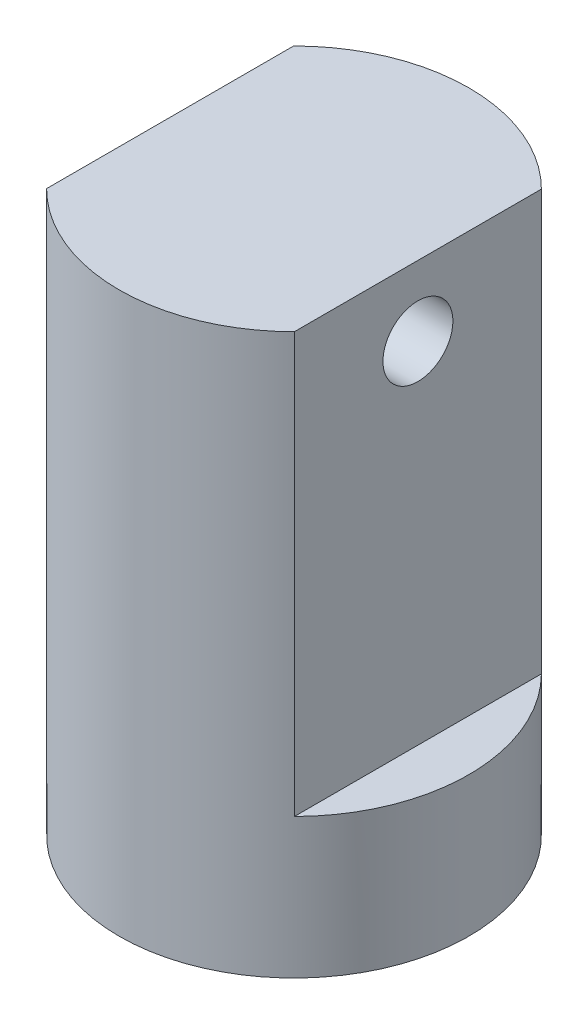
ISO-10303-21;
HEADER;
FILE_DESCRIPTION(('STEP AP214'),'2;1');
FILE_NAME('part.step','',(''),(''),'','','');
FILE_SCHEMA(('AUTOMOTIVE_DESIGN { 1 0 10303 214 1 1 1 1 }'));
ENDSEC;
DATA;
#1=APPLICATION_CONTEXT('core data for automotive mechanical design processes');
#2=APPLICATION_PROTOCOL_DEFINITION('international standard','automotive_design',2000,#1);
#3=PRODUCT_CONTEXT('',#1,'mechanical');
#4=PRODUCT('Part','Part','',(#3));
#5=PRODUCT_RELATED_PRODUCT_CATEGORY('part','',(#4));
#6=PRODUCT_DEFINITION_FORMATION('','',#4);
#7=PRODUCT_DEFINITION_CONTEXT('part definition',#1,'design');
#8=PRODUCT_DEFINITION('design','',#6,#7);
#9=PRODUCT_DEFINITION_SHAPE('','',#8);
#10=(LENGTH_UNIT() NAMED_UNIT(*) SI_UNIT(.MILLI.,.METRE.));
#11=(NAMED_UNIT(*) PLANE_ANGLE_UNIT() SI_UNIT($,.RADIAN.));
#12=(NAMED_UNIT(*) SI_UNIT($,.STERADIAN.) SOLID_ANGLE_UNIT());
#13=UNCERTAINTY_MEASURE_WITH_UNIT(LENGTH_MEASURE(1.E-05),#10,'distance_accuracy_value','');
#14=(GEOMETRIC_REPRESENTATION_CONTEXT(3) GLOBAL_UNCERTAINTY_ASSIGNED_CONTEXT((#13)) GLOBAL_UNIT_ASSIGNED_CONTEXT((#10,
#11,#12)) REPRESENTATION_CONTEXT('',''));
#15=CARTESIAN_POINT('',(0.,0.,0.));
#16=DIRECTION('',(0.,0.,1.));
#17=DIRECTION('',(1.,0.,0.));
#18=AXIS2_PLACEMENT_3D('',#15,#16,#17);
#19=CARTESIAN_POINT('',(0.,80.,0.));
#20=DIRECTION('',(0.,-1.,0.));
#21=DIRECTION('',(0.,0.,-1.));
#22=AXIS2_PLACEMENT_3D('',#19,#20,#21);
#23=CYLINDRICAL_SURFACE('',#22,25.);
#24=CARTESIAN_POINT('',(0.,80.,0.));
#25=DIRECTION('',(0.,1.,0.));
#26=DIRECTION('',(0.,0.,1.));
#27=AXIS2_PLACEMENT_3D('',#24,#25,#26);
#28=CIRCLE('',#27,25.);
#29=CARTESIAN_POINT('',(17.7081928215064,80.,-17.647093443294));
#30=VERTEX_POINT('',#29);
#31=CARTESIAN_POINT('',(-17.7081928215064,80.,-17.647093443294));
#32=VERTEX_POINT('',#31);
#33=EDGE_CURVE('E41',#30,#32,#28,.T.);
#34=ORIENTED_EDGE('',*,*,#33,.F.);
#35=DIRECTION('',(0.,1.,0.));
#36=VECTOR('',#35,1.);
#37=CARTESIAN_POINT('',(17.7081928215064,20.,-17.647093443294));
#38=LINE('',#37,#36);
#39=CARTESIAN_POINT('',(17.7081928215064,20.,-17.647093443294));
#40=VERTEX_POINT('',#39);
#41=EDGE_CURVE('E48',#40,#30,#38,.T.);
#42=ORIENTED_EDGE('',*,*,#41,.F.);
#43=CARTESIAN_POINT('',(0.,20.,0.));
#44=DIRECTION('',(0.,1.,0.));
#45=DIRECTION('',(0.,0.,1.));
#46=AXIS2_PLACEMENT_3D('',#43,#44,#45);
#47=CIRCLE('',#46,25.);
#48=CARTESIAN_POINT('',(17.7081928215064,20.,17.647093443294));
#49=VERTEX_POINT('',#48);
#50=EDGE_CURVE('E76',#49,#40,#47,.T.);
#51=ORIENTED_EDGE('',*,*,#50,.F.);
#52=DIRECTION('',(0.,1.,0.));
#53=VECTOR('',#52,1.);
#54=CARTESIAN_POINT('',(17.7081928215064,20.,17.647093443294));
#55=LINE('',#54,#53);
#56=CARTESIAN_POINT('',(17.7081928215064,80.,17.647093443294));
#57=VERTEX_POINT('',#56);
#58=EDGE_CURVE('E84',#49,#57,#55,.T.);
#59=ORIENTED_EDGE('',*,*,#58,.T.);
#60=CARTESIAN_POINT('',(-17.7081928215064,80.,17.647093443294));
#61=VERTEX_POINT('',#60);
#62=EDGE_CURVE('E11',#61,#57,#28,.T.);
#63=ORIENTED_EDGE('',*,*,#62,.F.);
#64=DIRECTION('',(0.,1.,0.));
#65=VECTOR('',#64,1.);
#66=CARTESIAN_POINT('',(-17.7081928215064,20.,17.647093443294));
#67=LINE('',#66,#65);
#68=CARTESIAN_POINT('',(-17.7081928215064,20.,17.647093443294));
#69=VERTEX_POINT('',#68);
#70=EDGE_CURVE('E56',#69,#61,#67,.T.);
#71=ORIENTED_EDGE('',*,*,#70,.F.);
#72=CARTESIAN_POINT('',(0.,20.,0.));
#73=DIRECTION('',(0.,1.,0.));
#74=DIRECTION('',(0.,0.,1.));
#75=AXIS2_PLACEMENT_3D('',#72,#73,#74);
#76=CIRCLE('',#75,25.);
#77=CARTESIAN_POINT('',(-17.7081928215064,20.,-17.647093443294));
#78=VERTEX_POINT('',#77);
#79=EDGE_CURVE('E96',#78,#69,#76,.T.);
#80=ORIENTED_EDGE('',*,*,#79,.F.);
#81=DIRECTION('',(0.,1.,0.));
#82=VECTOR('',#81,1.);
#83=CARTESIAN_POINT('',(-17.7081928215064,20.,-17.647093443294));
#84=LINE('',#83,#82);
#85=EDGE_CURVE('E99',#78,#32,#84,.T.);
#86=ORIENTED_EDGE('',*,*,#85,.T.);
#87=EDGE_LOOP('',(#34,#42,#51,#59,#63,#71,#80,#86));
#88=FACE_BOUND('',#87,.T.);
#89=CARTESIAN_POINT('',(0.,0.,0.));
#90=DIRECTION('',(0.,1.,0.));
#91=DIRECTION('',(0.,0.,1.));
#92=AXIS2_PLACEMENT_3D('',#89,#90,#91);
#93=CIRCLE('',#92,25.);
#94=CARTESIAN_POINT('',(0.,0.,25.));
#95=VERTEX_POINT('',#94);
#96=EDGE_CURVE('E36',#95,#95,#93,.T.);
#97=ORIENTED_EDGE('',*,*,#96,.T.);
#98=EDGE_LOOP('',(#97));
#99=FACE_BOUND('',#98,.T.);
#100=ADVANCED_FACE('F33',(#88,#99),#23,.T.);
#101=CARTESIAN_POINT('',(0.,80.,0.));
#102=DIRECTION('',(0.,1.,0.));
#103=DIRECTION('',(0.,0.,1.));
#104=AXIS2_PLACEMENT_3D('',#101,#102,#103);
#105=PLANE('',#104);
#106=DIRECTION('',(0.,0.,1.));
#107=VECTOR('',#106,1.);
#108=CARTESIAN_POINT('',(17.7081928215064,80.,0.));
#109=LINE('',#108,#107);
#110=EDGE_CURVE('E81',#30,#57,#109,.T.);
#111=ORIENTED_EDGE('',*,*,#110,.F.);
#112=ORIENTED_EDGE('',*,*,#33,.T.);
#113=DIRECTION('',(0.,0.,1.));
#114=VECTOR('',#113,1.);
#115=CARTESIAN_POINT('',(-17.7081928215064,80.,0.));
#116=LINE('',#115,#114);
#117=EDGE_CURVE('E90',#32,#61,#116,.T.);
#118=ORIENTED_EDGE('',*,*,#117,.T.);
#119=ORIENTED_EDGE('',*,*,#62,.T.);
#120=EDGE_LOOP('',(#111,#112,#118,#119));
#121=FACE_BOUND('',#120,.T.);
#122=ADVANCED_FACE('F109',(#121),#105,.T.);
#123=CARTESIAN_POINT('',(0.,0.,0.));
#124=DIRECTION('',(0.,1.,0.));
#125=DIRECTION('',(0.,0.,1.));
#126=AXIS2_PLACEMENT_3D('',#123,#124,#125);
#127=PLANE('',#126);
#128=CARTESIAN_POINT('',(0.,0.,0.));
#129=DIRECTION('',(0.,-1.,0.));
#130=DIRECTION('',(0.,0.,-1.));
#131=AXIS2_PLACEMENT_3D('',#128,#129,#130);
#132=CIRCLE('',#131,5.);
#133=CARTESIAN_POINT('',(0.,0.,-5.));
#134=VERTEX_POINT('',#133);
#135=EDGE_CURVE('E204',#134,#134,#132,.T.);
#136=ORIENTED_EDGE('',*,*,#135,.F.);
#137=EDGE_LOOP('',(#136));
#138=FACE_BOUND('',#137,.T.);
#139=ORIENTED_EDGE('',*,*,#96,.F.);
#140=EDGE_LOOP('',(#139));
#141=FACE_BOUND('',#140,.T.);
#142=ADVANCED_FACE('F113',(#138,#141),#127,.F.);
#143=CARTESIAN_POINT('',(-17.7081928215064,20.,0.));
#144=DIRECTION('',(-1.,0.,0.));
#145=DIRECTION('',(0.,0.,1.));
#146=AXIS2_PLACEMENT_3D('',#143,#144,#145);
#147=PLANE('',#146);
#148=CARTESIAN_POINT('',(-17.7081928215064,70.,0.));
#149=DIRECTION('',(-1.,0.,0.));
#150=DIRECTION('',(0.,0.,1.));
#151=AXIS2_PLACEMENT_3D('',#148,#149,#150);
#152=CIRCLE('',#151,5.);
#153=CARTESIAN_POINT('',(-17.7081928215064,70.,5.));
#154=VERTEX_POINT('',#153);
#155=EDGE_CURVE('E207',#154,#154,#152,.T.);
#156=ORIENTED_EDGE('',*,*,#155,.F.);
#157=EDGE_LOOP('',(#156));
#158=FACE_BOUND('',#157,.T.);
#159=ORIENTED_EDGE('',*,*,#117,.F.);
#160=ORIENTED_EDGE('',*,*,#85,.F.);
#161=DIRECTION('',(0.,0.,1.));
#162=VECTOR('',#161,1.);
#163=CARTESIAN_POINT('',(-17.7081928215064,20.,0.));
#164=LINE('',#163,#162);
#165=EDGE_CURVE('E94',#78,#69,#164,.T.);
#166=ORIENTED_EDGE('',*,*,#165,.T.);
#167=ORIENTED_EDGE('',*,*,#70,.T.);
#168=EDGE_LOOP('',(#159,#160,#166,#167));
#169=FACE_BOUND('',#168,.T.);
#170=ADVANCED_FACE('F104',(#158,#169),#147,.T.);
#171=CARTESIAN_POINT('',(0.,20.,0.));
#172=DIRECTION('',(0.,1.,0.));
#173=DIRECTION('',(0.,0.,1.));
#174=AXIS2_PLACEMENT_3D('',#171,#172,#173);
#175=PLANE('',#174);
#176=ORIENTED_EDGE('',*,*,#165,.F.);
#177=ORIENTED_EDGE('',*,*,#79,.T.);
#178=EDGE_LOOP('',(#176,#177));
#179=FACE_BOUND('',#178,.T.);
#180=ADVANCED_FACE('F106',(#179),#175,.T.);
#181=CARTESIAN_POINT('',(17.7081928215064,20.,0.));
#182=DIRECTION('',(-1.,0.,0.));
#183=DIRECTION('',(0.,0.,1.));
#184=AXIS2_PLACEMENT_3D('',#181,#182,#183);
#185=PLANE('',#184);
#186=CARTESIAN_POINT('',(17.7081928215064,70.,0.));
#187=DIRECTION('',(1.,0.,0.));
#188=DIRECTION('',(0.,0.,-1.));
#189=AXIS2_PLACEMENT_3D('',#186,#187,#188);
#190=CIRCLE('',#189,5.);
#191=CARTESIAN_POINT('',(17.7081928215064,70.,-5.));
#192=VERTEX_POINT('',#191);
#193=EDGE_CURVE('E203',#192,#192,#190,.T.);
#194=ORIENTED_EDGE('',*,*,#193,.F.);
#195=EDGE_LOOP('',(#194));
#196=FACE_BOUND('',#195,.T.);
#197=ORIENTED_EDGE('',*,*,#110,.T.);
#198=ORIENTED_EDGE('',*,*,#58,.F.);
#199=DIRECTION('',(0.,0.,1.));
#200=VECTOR('',#199,1.);
#201=CARTESIAN_POINT('',(17.7081928215064,20.,0.));
#202=LINE('',#201,#200);
#203=EDGE_CURVE('E78',#40,#49,#202,.T.);
#204=ORIENTED_EDGE('',*,*,#203,.F.);
#205=ORIENTED_EDGE('',*,*,#41,.T.);
#206=EDGE_LOOP('',(#197,#198,#204,#205));
#207=FACE_BOUND('',#206,.T.);
#208=ADVANCED_FACE('F83',(#196,#207),#185,.F.);
#209=CARTESIAN_POINT('',(0.,20.,0.));
#210=DIRECTION('',(0.,1.,0.));
#211=DIRECTION('',(0.,0.,1.));
#212=AXIS2_PLACEMENT_3D('',#209,#210,#211);
#213=PLANE('',#212);
#214=ORIENTED_EDGE('',*,*,#50,.T.);
#215=ORIENTED_EDGE('',*,*,#203,.T.);
#216=EDGE_LOOP('',(#214,#215));
#217=FACE_BOUND('',#216,.T.);
#218=ADVANCED_FACE('F77',(#217),#213,.T.);
#219=CARTESIAN_POINT('',(-42.2918071784936,70.,0.));
#220=DIRECTION('',(1.,0.,0.));
#221=DIRECTION('',(0.,0.,-1.));
#222=AXIS2_PLACEMENT_3D('',#219,#220,#221);
#223=CYLINDRICAL_SURFACE('',#222,5.);
#224=ORIENTED_EDGE('',*,*,#155,.T.);
#225=EDGE_LOOP('',(#224));
#226=FACE_BOUND('',#225,.T.);
#227=ORIENTED_EDGE('',*,*,#193,.T.);
#228=EDGE_LOOP('',(#227));
#229=FACE_BOUND('',#228,.T.);
#230=ADVANCED_FACE('F152',(#226,#229),#223,.F.);
#231=CARTESIAN_POINT('',(0.,30.,0.));
#232=DIRECTION('',(0.,-1.,0.));
#233=DIRECTION('',(0.,0.,-1.));
#234=AXIS2_PLACEMENT_3D('',#231,#232,#233);
#235=CYLINDRICAL_SURFACE('',#234,5.);
#236=CARTESIAN_POINT('',(0.,30.,0.));
#237=DIRECTION('',(0.,-1.,0.));
#238=DIRECTION('',(0.,0.,-1.));
#239=AXIS2_PLACEMENT_3D('',#236,#237,#238);
#240=CIRCLE('',#239,5.);
#241=CARTESIAN_POINT('',(0.,30.,-5.));
#242=VERTEX_POINT('',#241);
#243=EDGE_CURVE('E202',#242,#242,#240,.T.);
#244=ORIENTED_EDGE('',*,*,#243,.F.);
#245=EDGE_LOOP('',(#244));
#246=FACE_BOUND('',#245,.T.);
#247=ORIENTED_EDGE('',*,*,#135,.T.);
#248=EDGE_LOOP('',(#247));
#249=FACE_BOUND('',#248,.T.);
#250=ADVANCED_FACE('F172',(#246,#249),#235,.F.);
#251=CARTESIAN_POINT('',(0.,30.,0.));
#252=DIRECTION('',(0.,-1.,0.));
#253=DIRECTION('',(0.,0.,-1.));
#254=AXIS2_PLACEMENT_3D('',#251,#252,#253);
#255=PLANE('',#254);
#256=ORIENTED_EDGE('',*,*,#243,.T.);
#257=EDGE_LOOP('',(#256));
#258=FACE_BOUND('',#257,.T.);
#259=ADVANCED_FACE('F186',(#258),#255,.T.);
#260=CLOSED_SHELL('',(#100,#122,#142,#170,#180,#208,#218,#230,#250,#259));
#261=MANIFOLD_SOLID_BREP('B2',#260);
#262=ADVANCED_BREP_SHAPE_REPRESENTATION('',(#18,#261),#14);
#263=SHAPE_DEFINITION_REPRESENTATION(#9,#262);
ENDSEC;
END-ISO-10303-21;
